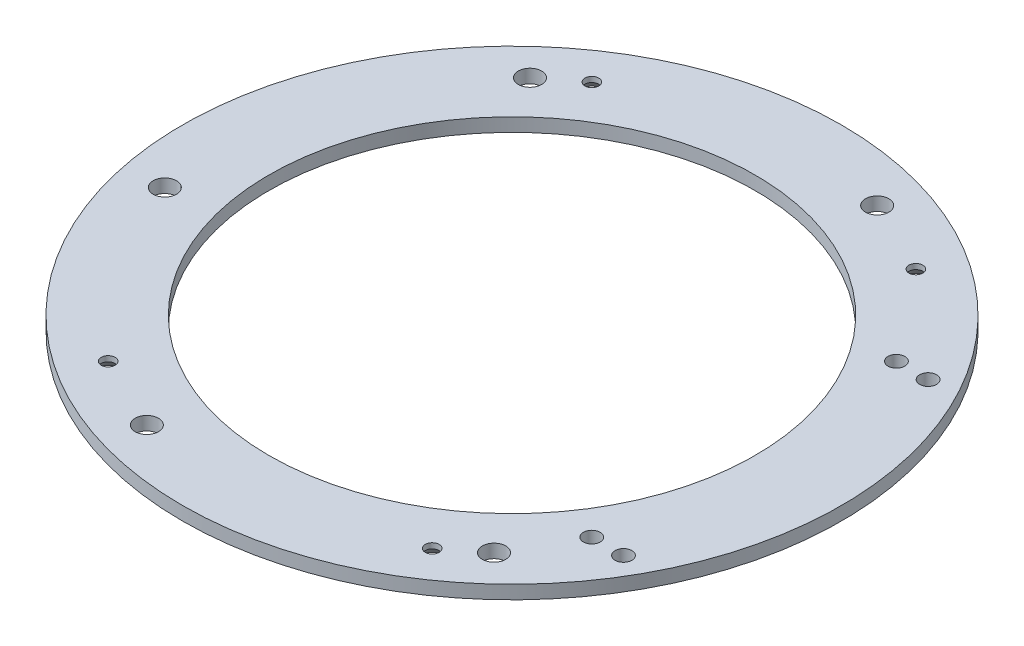
ISO-10303-21;
HEADER;
FILE_DESCRIPTION(('STEP AP214'),'2;1');
FILE_NAME('part.step','',(''),(''),'','','');
FILE_SCHEMA(('AUTOMOTIVE_DESIGN { 1 0 10303 214 1 1 1 1 }'));
ENDSEC;
DATA;
#1=APPLICATION_CONTEXT('core data for automotive mechanical design processes');
#2=APPLICATION_PROTOCOL_DEFINITION('international standard','automotive_design',2000,#1);
#3=PRODUCT_CONTEXT('',#1,'mechanical');
#4=PRODUCT('Part','Part','',(#3));
#5=PRODUCT_RELATED_PRODUCT_CATEGORY('part','',(#4));
#6=PRODUCT_DEFINITION_FORMATION('','',#4);
#7=PRODUCT_DEFINITION_CONTEXT('part definition',#1,'design');
#8=PRODUCT_DEFINITION('design','',#6,#7);
#9=PRODUCT_DEFINITION_SHAPE('','',#8);
#10=(LENGTH_UNIT() NAMED_UNIT(*) SI_UNIT(.MILLI.,.METRE.));
#11=(NAMED_UNIT(*) PLANE_ANGLE_UNIT() SI_UNIT($,.RADIAN.));
#12=(NAMED_UNIT(*) SI_UNIT($,.STERADIAN.) SOLID_ANGLE_UNIT());
#13=UNCERTAINTY_MEASURE_WITH_UNIT(LENGTH_MEASURE(1.E-05),#10,'distance_accuracy_value','');
#14=(GEOMETRIC_REPRESENTATION_CONTEXT(3) GLOBAL_UNCERTAINTY_ASSIGNED_CONTEXT((#13)) GLOBAL_UNIT_ASSIGNED_CONTEXT((#10,
#11,#12)) REPRESENTATION_CONTEXT('',''));
#15=CARTESIAN_POINT('',(0.,0.,0.));
#16=DIRECTION('',(0.,0.,1.));
#17=DIRECTION('',(1.,0.,0.));
#18=AXIS2_PLACEMENT_3D('',#15,#16,#17);
#19=CARTESIAN_POINT('',(0.,-43.50766,0.));
#20=DIRECTION('',(0.,1.,0.));
#21=DIRECTION('',(0.,0.,1.));
#22=AXIS2_PLACEMENT_3D('',#19,#20,#21);
#23=PLANE('',#22);
#24=CARTESIAN_POINT('',(62.0316676222717,-43.50766,35.8140000000001));
#25=DIRECTION('',(0.,1.,0.));
#26=DIRECTION('',(0.,0.,1.));
#27=AXIS2_PLACEMENT_3D('',#24,#25,#26);
#28=CIRCLE('',#27,1.984375);
#29=CARTESIAN_POINT('',(62.0316676222717,-43.50766,37.7983750000001));
#30=VERTEX_POINT('',#29);
#31=EDGE_CURVE('E154',#30,#30,#28,.T.);
#32=ORIENTED_EDGE('',*,*,#31,.T.);
#33=EDGE_LOOP('',(#32));
#34=FACE_BOUND('',#33,.T.);
#35=CARTESIAN_POINT('',(54.5763198466148,-43.50766,35.8140000000001));
#36=DIRECTION('',(0.,1.,0.));
#37=DIRECTION('',(0.,0.,1.));
#38=AXIS2_PLACEMENT_3D('',#35,#36,#37);
#39=CIRCLE('',#38,1.984375);
#40=CARTESIAN_POINT('',(54.5763198466148,-43.50766,37.7983750000001));
#41=VERTEX_POINT('',#40);
#42=EDGE_CURVE('E148',#41,#41,#39,.T.);
#43=ORIENTED_EDGE('',*,*,#42,.T.);
#44=EDGE_LOOP('',(#43));
#45=FACE_BOUND('',#44,.T.);
#46=CARTESIAN_POINT('',(54.5763198466148,-43.50766,-35.8140000000001));
#47=DIRECTION('',(0.,1.,0.));
#48=DIRECTION('',(0.,0.,1.));
#49=AXIS2_PLACEMENT_3D('',#46,#47,#48);
#50=CIRCLE('',#49,1.984375);
#51=CARTESIAN_POINT('',(54.5763198466148,-43.50766,-33.8296250000001));
#52=VERTEX_POINT('',#51);
#53=EDGE_CURVE('E142',#52,#52,#50,.T.);
#54=ORIENTED_EDGE('',*,*,#53,.T.);
#55=EDGE_LOOP('',(#54));
#56=FACE_BOUND('',#55,.T.);
#57=CARTESIAN_POINT('',(62.0316676222717,-43.50766,-35.8140000000001));
#58=DIRECTION('',(0.,1.,0.));
#59=DIRECTION('',(0.,0.,1.));
#60=AXIS2_PLACEMENT_3D('',#57,#58,#59);
#61=CIRCLE('',#60,1.984375);
#62=CARTESIAN_POINT('',(62.0316676222717,-43.50766,-33.8296250000001));
#63=VERTEX_POINT('',#62);
#64=EDGE_CURVE('E136',#63,#63,#61,.T.);
#65=ORIENTED_EDGE('',*,*,#64,.T.);
#66=EDGE_LOOP('',(#65));
#67=FACE_BOUND('',#66,.T.);
#68=CARTESIAN_POINT('',(38.1,-43.50766,56.8700554685856));
#69=DIRECTION('',(0.,-1.,0.));
#70=DIRECTION('',(0.,0.,-1.));
#71=AXIS2_PLACEMENT_3D('',#68,#69,#70);
#72=CIRCLE('',#71,3.302);
#73=CARTESIAN_POINT('',(38.1,-43.50766,53.5680554685856));
#74=VERTEX_POINT('',#73);
#75=EDGE_CURVE('E115',#74,#74,#72,.T.);
#76=ORIENTED_EDGE('',*,*,#75,.F.);
#77=EDGE_LOOP('',(#76));
#78=FACE_BOUND('',#77,.T.);
#79=CARTESIAN_POINT('',(20.5842140934656,-43.50766,-65.2847864295685));
#80=DIRECTION('',(0.,1.,0.));
#81=DIRECTION('',(0.,0.,1.));
#82=AXIS2_PLACEMENT_3D('',#79,#80,#81);
#83=CIRCLE('',#82,2.75);
#84=CARTESIAN_POINT('',(20.5842140934656,-43.50766,-62.5347864295685));
#85=VERTEX_POINT('',#84);
#86=EDGE_CURVE('E94',#85,#85,#83,.T.);
#87=ORIENTED_EDGE('',*,*,#86,.T.);
#88=EDGE_LOOP('',(#87));
#89=FACE_BOUND('',#88,.T.);
#90=CARTESIAN_POINT('',(46.2461764819152,-43.50766,50.4688455366631));
#91=DIRECTION('',(0.,1.,0.));
#92=DIRECTION('',(0.,0.,1.));
#93=AXIS2_PLACEMENT_3D('',#90,#91,#92);
#94=CIRCLE('',#93,2.75);
#95=CARTESIAN_POINT('',(46.2461764819152,-43.50766,53.2188455366631));
#96=VERTEX_POINT('',#95);
#97=EDGE_CURVE('E88',#96,#96,#94,.T.);
#98=ORIENTED_EDGE('',*,*,#97,.T.);
#99=EDGE_LOOP('',(#98));
#100=FACE_BOUND('',#99,.T.);
#101=CARTESIAN_POINT('',(-20.5842140934656,-43.50766,65.2847864295685));
#102=DIRECTION('',(0.,1.,0.));
#103=DIRECTION('',(0.,0.,1.));
#104=AXIS2_PLACEMENT_3D('',#101,#102,#103);
#105=CIRCLE('',#104,2.75);
#106=CARTESIAN_POINT('',(-20.5842140934656,-43.50766,68.0347864295685));
#107=VERTEX_POINT('',#106);
#108=EDGE_CURVE('E82',#107,#107,#105,.T.);
#109=ORIENTED_EDGE('',*,*,#108,.T.);
#110=EDGE_LOOP('',(#109));
#111=FACE_BOUND('',#110,.T.);
#112=CARTESIAN_POINT('',(-46.2461764819152,-43.50766,-50.4688455366631));
#113=DIRECTION('',(0.,1.,0.));
#114=DIRECTION('',(0.,0.,1.));
#115=AXIS2_PLACEMENT_3D('',#112,#113,#114);
#116=CIRCLE('',#115,2.75);
#117=CARTESIAN_POINT('',(-46.2461764819152,-43.50766,-47.7188455366631));
#118=VERTEX_POINT('',#117);
#119=EDGE_CURVE('E73',#118,#118,#116,.T.);
#120=ORIENTED_EDGE('',*,*,#119,.T.);
#121=EDGE_LOOP('',(#120));
#122=FACE_BOUND('',#121,.T.);
#123=CARTESIAN_POINT('',(-66.8303905753807,-43.50766,14.8159408929054));
#124=DIRECTION('',(0.,1.,0.));
#125=DIRECTION('',(0.,0.,1.));
#126=AXIS2_PLACEMENT_3D('',#123,#124,#125);
#127=CIRCLE('',#126,2.75);
#128=CARTESIAN_POINT('',(-66.8303905753807,-43.50766,17.5659408929054));
#129=VERTEX_POINT('',#128);
#130=EDGE_CURVE('E63',#129,#129,#127,.T.);
#131=ORIENTED_EDGE('',*,*,#130,.T.);
#132=EDGE_LOOP('',(#131));
#133=FACE_BOUND('',#132,.T.);
#134=CARTESIAN_POINT('',(0.,-43.50766,0.));
#135=DIRECTION('',(0.,1.,0.));
#136=DIRECTION('',(0.,0.,1.));
#137=AXIS2_PLACEMENT_3D('',#134,#135,#136);
#138=CIRCLE('',#137,77.4954);
#139=CARTESIAN_POINT('',(0.,-43.50766,77.4954));
#140=VERTEX_POINT('',#139);
#141=EDGE_CURVE('E10',#140,#140,#138,.F.);
#142=ORIENTED_EDGE('',*,*,#141,.T.);
#143=EDGE_LOOP('',(#142));
#144=FACE_BOUND('',#143,.T.);
#145=CARTESIAN_POINT('',(0.,-43.50766,0.));
#146=DIRECTION('',(0.,1.,0.));
#147=DIRECTION('',(0.,0.,1.));
#148=AXIS2_PLACEMENT_3D('',#145,#146,#147);
#149=CIRCLE('',#148,57.15);
#150=CARTESIAN_POINT('',(0.,-43.50766,57.15));
#151=VERTEX_POINT('',#150);
#152=EDGE_CURVE('E60',#151,#151,#149,.F.);
#153=ORIENTED_EDGE('',*,*,#152,.F.);
#154=EDGE_LOOP('',(#153));
#155=FACE_BOUND('',#154,.T.);
#156=CARTESIAN_POINT('',(-38.1,-43.50766,56.8700554685856));
#157=DIRECTION('',(0.,-1.,0.));
#158=DIRECTION('',(0.,0.,-1.));
#159=AXIS2_PLACEMENT_3D('',#156,#157,#158);
#160=CIRCLE('',#159,3.302);
#161=CARTESIAN_POINT('',(-38.1,-43.50766,53.5680554685856));
#162=VERTEX_POINT('',#161);
#163=EDGE_CURVE('E106',#162,#162,#160,.T.);
#164=ORIENTED_EDGE('',*,*,#163,.F.);
#165=EDGE_LOOP('',(#164));
#166=FACE_BOUND('',#165,.T.);
#167=CARTESIAN_POINT('',(-38.1,-43.50766,-56.8700554685856));
#168=DIRECTION('',(0.,-1.,0.));
#169=DIRECTION('',(0.,0.,-1.));
#170=AXIS2_PLACEMENT_3D('',#167,#168,#169);
#171=CIRCLE('',#170,3.302);
#172=CARTESIAN_POINT('',(-38.1,-43.50766,-60.1720554685856));
#173=VERTEX_POINT('',#172);
#174=EDGE_CURVE('E124',#173,#173,#171,.T.);
#175=ORIENTED_EDGE('',*,*,#174,.F.);
#176=EDGE_LOOP('',(#175));
#177=FACE_BOUND('',#176,.T.);
#178=CARTESIAN_POINT('',(38.1,-43.50766,-56.8700554685856));
#179=DIRECTION('',(0.,-1.,0.));
#180=DIRECTION('',(0.,0.,-1.));
#181=AXIS2_PLACEMENT_3D('',#178,#179,#180);
#182=CIRCLE('',#181,3.302);
#183=CARTESIAN_POINT('',(38.1,-43.50766,-60.1720554685856));
#184=VERTEX_POINT('',#183);
#185=EDGE_CURVE('E133',#184,#184,#182,.T.);
#186=ORIENTED_EDGE('',*,*,#185,.F.);
#187=EDGE_LOOP('',(#186));
#188=FACE_BOUND('',#187,.T.);
#189=ADVANCED_FACE('F45',(#34,#45,#56,#67,#78,#89,#100,#111,#122,#133,#144,#155,#166,#177,#188),
#23,.F.);
#190=CARTESIAN_POINT('',(0.,-262.697751403056,0.));
#191=DIRECTION('',(0.,1.,0.));
#192=DIRECTION('',(0.,0.,1.));
#193=AXIS2_PLACEMENT_3D('',#190,#191,#192);
#194=CYLINDRICAL_SURFACE('',#193,57.15);
#195=ORIENTED_EDGE('',*,*,#152,.T.);
#196=EDGE_LOOP('',(#195));
#197=FACE_BOUND('',#196,.T.);
#198=CARTESIAN_POINT('',(0.,-40.33266,0.));
#199=DIRECTION('',(0.,1.,0.));
#200=DIRECTION('',(0.,0.,1.));
#201=AXIS2_PLACEMENT_3D('',#198,#199,#200);
#202=CIRCLE('',#201,57.15);
#203=CARTESIAN_POINT('',(0.,-40.33266,57.15));
#204=VERTEX_POINT('',#203);
#205=EDGE_CURVE('E55',#204,#204,#202,.T.);
#206=ORIENTED_EDGE('',*,*,#205,.T.);
#207=EDGE_LOOP('',(#206));
#208=FACE_BOUND('',#207,.T.);
#209=ADVANCED_FACE('F194',(#197,#208),#194,.F.);
#210=CARTESIAN_POINT('',(0.,-262.697751403056,0.));
#211=DIRECTION('',(0.,1.,0.));
#212=DIRECTION('',(0.,0.,1.));
#213=AXIS2_PLACEMENT_3D('',#210,#211,#212);
#214=CYLINDRICAL_SURFACE('',#213,77.4954);
#215=ORIENTED_EDGE('',*,*,#141,.F.);
#216=EDGE_LOOP('',(#215));
#217=FACE_BOUND('',#216,.T.);
#218=CARTESIAN_POINT('',(0.,-40.33266,0.));
#219=DIRECTION('',(0.,1.,0.));
#220=DIRECTION('',(0.,0.,1.));
#221=AXIS2_PLACEMENT_3D('',#218,#219,#220);
#222=CIRCLE('',#221,77.4954);
#223=CARTESIAN_POINT('',(0.,-40.33266,77.4954));
#224=VERTEX_POINT('',#223);
#225=EDGE_CURVE('E51',#224,#224,#222,.T.);
#226=ORIENTED_EDGE('',*,*,#225,.F.);
#227=EDGE_LOOP('',(#226));
#228=FACE_BOUND('',#227,.T.);
#229=ADVANCED_FACE('F167',(#217,#228),#214,.T.);
#230=CARTESIAN_POINT('',(0.,-40.33266,0.));
#231=DIRECTION('',(0.,1.,0.));
#232=DIRECTION('',(0.,0.,1.));
#233=AXIS2_PLACEMENT_3D('',#230,#231,#232);
#234=PLANE('',#233);
#235=CARTESIAN_POINT('',(62.0316676222717,-40.33266,35.8140000000001));
#236=DIRECTION('',(0.,1.,0.));
#237=DIRECTION('',(0.,0.,1.));
#238=AXIS2_PLACEMENT_3D('',#235,#236,#237);
#239=CIRCLE('',#238,1.984375);
#240=CARTESIAN_POINT('',(62.0316676222717,-40.33266,37.7983750000001));
#241=VERTEX_POINT('',#240);
#242=EDGE_CURVE('E157',#241,#241,#239,.T.);
#243=ORIENTED_EDGE('',*,*,#242,.F.);
#244=EDGE_LOOP('',(#243));
#245=FACE_BOUND('',#244,.T.);
#246=CARTESIAN_POINT('',(54.5763198466148,-40.33266,35.8140000000001));
#247=DIRECTION('',(0.,1.,0.));
#248=DIRECTION('',(0.,0.,1.));
#249=AXIS2_PLACEMENT_3D('',#246,#247,#248);
#250=CIRCLE('',#249,1.984375);
#251=CARTESIAN_POINT('',(54.5763198466148,-40.33266,37.7983750000001));
#252=VERTEX_POINT('',#251);
#253=EDGE_CURVE('E151',#252,#252,#250,.T.);
#254=ORIENTED_EDGE('',*,*,#253,.F.);
#255=EDGE_LOOP('',(#254));
#256=FACE_BOUND('',#255,.T.);
#257=CARTESIAN_POINT('',(54.5763198466148,-40.33266,-35.8140000000001));
#258=DIRECTION('',(0.,1.,0.));
#259=DIRECTION('',(0.,0.,1.));
#260=AXIS2_PLACEMENT_3D('',#257,#258,#259);
#261=CIRCLE('',#260,1.984375);
#262=CARTESIAN_POINT('',(54.5763198466148,-40.33266,-33.8296250000001));
#263=VERTEX_POINT('',#262);
#264=EDGE_CURVE('E145',#263,#263,#261,.T.);
#265=ORIENTED_EDGE('',*,*,#264,.F.);
#266=EDGE_LOOP('',(#265));
#267=FACE_BOUND('',#266,.T.);
#268=CARTESIAN_POINT('',(62.0316676222717,-40.33266,-35.8140000000001));
#269=DIRECTION('',(0.,1.,0.));
#270=DIRECTION('',(0.,0.,1.));
#271=AXIS2_PLACEMENT_3D('',#268,#269,#270);
#272=CIRCLE('',#271,1.984375);
#273=CARTESIAN_POINT('',(62.0316676222717,-40.33266,-33.8296250000001));
#274=VERTEX_POINT('',#273);
#275=EDGE_CURVE('E139',#274,#274,#272,.T.);
#276=ORIENTED_EDGE('',*,*,#275,.F.);
#277=EDGE_LOOP('',(#276));
#278=FACE_BOUND('',#277,.T.);
#279=CARTESIAN_POINT('',(38.1,-40.33266,-56.8700554685856));
#280=DIRECTION('',(0.,1.,0.));
#281=DIRECTION('',(0.,0.,1.));
#282=AXIS2_PLACEMENT_3D('',#279,#280,#281);
#283=CIRCLE('',#282,1.63195);
#284=CARTESIAN_POINT('',(38.1,-40.33266,-55.2381054685856));
#285=VERTEX_POINT('',#284);
#286=EDGE_CURVE('E127',#285,#285,#283,.T.);
#287=ORIENTED_EDGE('',*,*,#286,.F.);
#288=EDGE_LOOP('',(#287));
#289=FACE_BOUND('',#288,.T.);
#290=CARTESIAN_POINT('',(-38.1,-40.33266,-56.8700554685856));
#291=DIRECTION('',(0.,1.,0.));
#292=DIRECTION('',(0.,0.,1.));
#293=AXIS2_PLACEMENT_3D('',#290,#291,#292);
#294=CIRCLE('',#293,1.63195);
#295=CARTESIAN_POINT('',(-38.1,-40.33266,-55.2381054685856));
#296=VERTEX_POINT('',#295);
#297=EDGE_CURVE('E118',#296,#296,#294,.T.);
#298=ORIENTED_EDGE('',*,*,#297,.F.);
#299=EDGE_LOOP('',(#298));
#300=FACE_BOUND('',#299,.T.);
#301=CARTESIAN_POINT('',(38.1,-40.33266,56.8700554685856));
#302=DIRECTION('',(0.,1.,0.));
#303=DIRECTION('',(0.,0.,1.));
#304=AXIS2_PLACEMENT_3D('',#301,#302,#303);
#305=CIRCLE('',#304,1.63195);
#306=CARTESIAN_POINT('',(38.1,-40.33266,58.5020054685856));
#307=VERTEX_POINT('',#306);
#308=EDGE_CURVE('E109',#307,#307,#305,.T.);
#309=ORIENTED_EDGE('',*,*,#308,.F.);
#310=EDGE_LOOP('',(#309));
#311=FACE_BOUND('',#310,.T.);
#312=CARTESIAN_POINT('',(-38.1,-40.33266,56.8700554685856));
#313=DIRECTION('',(0.,1.,0.));
#314=DIRECTION('',(0.,0.,1.));
#315=AXIS2_PLACEMENT_3D('',#312,#313,#314);
#316=CIRCLE('',#315,1.63195);
#317=CARTESIAN_POINT('',(-38.1,-40.33266,58.5020054685856));
#318=VERTEX_POINT('',#317);
#319=EDGE_CURVE('E100',#318,#318,#316,.T.);
#320=ORIENTED_EDGE('',*,*,#319,.F.);
#321=EDGE_LOOP('',(#320));
#322=FACE_BOUND('',#321,.T.);
#323=CARTESIAN_POINT('',(20.5842140934656,-40.33266,-65.2847864295685));
#324=DIRECTION('',(0.,1.,0.));
#325=DIRECTION('',(0.,0.,1.));
#326=AXIS2_PLACEMENT_3D('',#323,#324,#325);
#327=CIRCLE('',#326,2.75);
#328=CARTESIAN_POINT('',(20.5842140934656,-40.33266,-62.5347864295685));
#329=VERTEX_POINT('',#328);
#330=EDGE_CURVE('E97',#329,#329,#327,.T.);
#331=ORIENTED_EDGE('',*,*,#330,.F.);
#332=EDGE_LOOP('',(#331));
#333=FACE_BOUND('',#332,.T.);
#334=CARTESIAN_POINT('',(46.2461764819152,-40.33266,50.4688455366631));
#335=DIRECTION('',(0.,1.,0.));
#336=DIRECTION('',(0.,0.,1.));
#337=AXIS2_PLACEMENT_3D('',#334,#335,#336);
#338=CIRCLE('',#337,2.75);
#339=CARTESIAN_POINT('',(46.2461764819152,-40.33266,53.2188455366631));
#340=VERTEX_POINT('',#339);
#341=EDGE_CURVE('E91',#340,#340,#338,.T.);
#342=ORIENTED_EDGE('',*,*,#341,.F.);
#343=EDGE_LOOP('',(#342));
#344=FACE_BOUND('',#343,.T.);
#345=CARTESIAN_POINT('',(-20.5842140934656,-40.33266,65.2847864295685));
#346=DIRECTION('',(0.,1.,0.));
#347=DIRECTION('',(0.,0.,1.));
#348=AXIS2_PLACEMENT_3D('',#345,#346,#347);
#349=CIRCLE('',#348,2.75);
#350=CARTESIAN_POINT('',(-20.5842140934656,-40.33266,68.0347864295685));
#351=VERTEX_POINT('',#350);
#352=EDGE_CURVE('E85',#351,#351,#349,.T.);
#353=ORIENTED_EDGE('',*,*,#352,.F.);
#354=EDGE_LOOP('',(#353));
#355=FACE_BOUND('',#354,.T.);
#356=CARTESIAN_POINT('',(-46.2461764819152,-40.33266,-50.4688455366631));
#357=DIRECTION('',(0.,1.,0.));
#358=DIRECTION('',(0.,0.,1.));
#359=AXIS2_PLACEMENT_3D('',#356,#357,#358);
#360=CIRCLE('',#359,2.75);
#361=CARTESIAN_POINT('',(-46.2461764819152,-40.33266,-47.7188455366631));
#362=VERTEX_POINT('',#361);
#363=EDGE_CURVE('E77',#362,#362,#360,.T.);
#364=ORIENTED_EDGE('',*,*,#363,.F.);
#365=EDGE_LOOP('',(#364));
#366=FACE_BOUND('',#365,.T.);
#367=CARTESIAN_POINT('',(-66.8303905753807,-40.33266,14.8159408929054));
#368=DIRECTION('',(0.,1.,0.));
#369=DIRECTION('',(0.,0.,1.));
#370=AXIS2_PLACEMENT_3D('',#367,#368,#369);
#371=CIRCLE('',#370,2.75);
#372=CARTESIAN_POINT('',(-66.8303905753807,-40.33266,17.5659408929054));
#373=VERTEX_POINT('',#372);
#374=EDGE_CURVE('E69',#373,#373,#371,.T.);
#375=ORIENTED_EDGE('',*,*,#374,.F.);
#376=EDGE_LOOP('',(#375));
#377=FACE_BOUND('',#376,.T.);
#378=ORIENTED_EDGE('',*,*,#205,.F.);
#379=EDGE_LOOP('',(#378));
#380=FACE_BOUND('',#379,.T.);
#381=ORIENTED_EDGE('',*,*,#225,.T.);
#382=EDGE_LOOP('',(#381));
#383=FACE_BOUND('',#382,.T.);
#384=ADVANCED_FACE('F163',(#245,#256,#267,#278,#289,#300,#311,#322,#333,#344,#355,#366,#377,
#380,#383),#234,.T.);
#385=CARTESIAN_POINT('',(-66.8303905753807,-40.33266,14.8159408929054));
#386=DIRECTION('',(0.,1.,0.));
#387=DIRECTION('',(0.,0.,1.));
#388=AXIS2_PLACEMENT_3D('',#385,#386,#387);
#389=CYLINDRICAL_SURFACE('',#388,2.75);
#390=ORIENTED_EDGE('',*,*,#130,.F.);
#391=EDGE_LOOP('',(#390));
#392=FACE_BOUND('',#391,.T.);
#393=ORIENTED_EDGE('',*,*,#374,.T.);
#394=EDGE_LOOP('',(#393));
#395=FACE_BOUND('',#394,.T.);
#396=ADVANCED_FACE('F166',(#392,#395),#389,.F.);
#397=CARTESIAN_POINT('',(-46.2461764819152,-40.33266,-50.4688455366631));
#398=DIRECTION('',(0.,1.,0.));
#399=DIRECTION('',(0.,0.,1.));
#400=AXIS2_PLACEMENT_3D('',#397,#398,#399);
#401=CYLINDRICAL_SURFACE('',#400,2.75);
#402=ORIENTED_EDGE('',*,*,#119,.F.);
#403=EDGE_LOOP('',(#402));
#404=FACE_BOUND('',#403,.T.);
#405=ORIENTED_EDGE('',*,*,#363,.T.);
#406=EDGE_LOOP('',(#405));
#407=FACE_BOUND('',#406,.T.);
#408=ADVANCED_FACE('F206',(#404,#407),#401,.F.);
#409=CARTESIAN_POINT('',(-20.5842140934656,-40.33266,65.2847864295685));
#410=DIRECTION('',(0.,1.,0.));
#411=DIRECTION('',(0.,0.,1.));
#412=AXIS2_PLACEMENT_3D('',#409,#410,#411);
#413=CYLINDRICAL_SURFACE('',#412,2.75);
#414=ORIENTED_EDGE('',*,*,#108,.F.);
#415=EDGE_LOOP('',(#414));
#416=FACE_BOUND('',#415,.T.);
#417=ORIENTED_EDGE('',*,*,#352,.T.);
#418=EDGE_LOOP('',(#417));
#419=FACE_BOUND('',#418,.T.);
#420=ADVANCED_FACE('F210',(#416,#419),#413,.F.);
#421=CARTESIAN_POINT('',(46.2461764819152,-40.33266,50.4688455366631));
#422=DIRECTION('',(0.,1.,0.));
#423=DIRECTION('',(0.,0.,1.));
#424=AXIS2_PLACEMENT_3D('',#421,#422,#423);
#425=CYLINDRICAL_SURFACE('',#424,2.75);
#426=ORIENTED_EDGE('',*,*,#97,.F.);
#427=EDGE_LOOP('',(#426));
#428=FACE_BOUND('',#427,.T.);
#429=ORIENTED_EDGE('',*,*,#341,.T.);
#430=EDGE_LOOP('',(#429));
#431=FACE_BOUND('',#430,.T.);
#432=ADVANCED_FACE('F214',(#428,#431),#425,.F.);
#433=CARTESIAN_POINT('',(20.5842140934656,-40.33266,-65.2847864295685));
#434=DIRECTION('',(0.,1.,0.));
#435=DIRECTION('',(0.,0.,1.));
#436=AXIS2_PLACEMENT_3D('',#433,#434,#435);
#437=CYLINDRICAL_SURFACE('',#436,2.75);
#438=ORIENTED_EDGE('',*,*,#86,.F.);
#439=EDGE_LOOP('',(#438));
#440=FACE_BOUND('',#439,.T.);
#441=ORIENTED_EDGE('',*,*,#330,.T.);
#442=EDGE_LOOP('',(#441));
#443=FACE_BOUND('',#442,.T.);
#444=ADVANCED_FACE('F218',(#440,#443),#437,.F.);
#445=CARTESIAN_POINT('',(-38.1,-43.50766,56.8700554685856));
#446=DIRECTION('',(0.,-1.,0.));
#447=DIRECTION('',(0.,0.,-1.));
#448=AXIS2_PLACEMENT_3D('',#445,#446,#447);
#449=CYLINDRICAL_SURFACE('',#448,1.63195);
#450=CARTESIAN_POINT('',(-38.1,-41.5864872415205,56.8700554685856));
#451=DIRECTION('',(0.,-1.,0.));
#452=DIRECTION('',(0.,0.,-1.));
#453=AXIS2_PLACEMENT_3D('',#450,#451,#452);
#454=CIRCLE('',#453,1.63195);
#455=CARTESIAN_POINT('',(-38.1,-41.5864872415205,55.2381054685856));
#456=VERTEX_POINT('',#455);
#457=EDGE_CURVE('E103',#456,#456,#454,.T.);
#458=ORIENTED_EDGE('',*,*,#457,.T.);
#459=EDGE_LOOP('',(#458));
#460=FACE_BOUND('',#459,.T.);
#461=ORIENTED_EDGE('',*,*,#319,.T.);
#462=EDGE_LOOP('',(#461));
#463=FACE_BOUND('',#462,.T.);
#464=ADVANCED_FACE('F222',(#460,#463),#449,.F.);
#465=CARTESIAN_POINT('',(-38.1,-43.50766,56.8700554685856));
#466=DIRECTION('',(0.,-1.,0.));
#467=DIRECTION('',(0.,0.,-1.));
#468=AXIS2_PLACEMENT_3D('',#465,#466,#467);
#469=CONICAL_SURFACE('',#468,3.302,0.715584993317674);
#470=ORIENTED_EDGE('',*,*,#457,.F.);
#471=EDGE_LOOP('',(#470));
#472=FACE_BOUND('',#471,.T.);
#473=ORIENTED_EDGE('',*,*,#163,.T.);
#474=EDGE_LOOP('',(#473));
#475=FACE_BOUND('',#474,.T.);
#476=ADVANCED_FACE('F226',(#472,#475),#469,.F.);
#477=CARTESIAN_POINT('',(38.1,-43.50766,56.8700554685856));
#478=DIRECTION('',(0.,-1.,0.));
#479=DIRECTION('',(0.,0.,-1.));
#480=AXIS2_PLACEMENT_3D('',#477,#478,#479);
#481=CYLINDRICAL_SURFACE('',#480,1.63195);
#482=CARTESIAN_POINT('',(38.1,-41.5864872415205,56.8700554685856));
#483=DIRECTION('',(0.,-1.,0.));
#484=DIRECTION('',(0.,0.,-1.));
#485=AXIS2_PLACEMENT_3D('',#482,#483,#484);
#486=CIRCLE('',#485,1.63195);
#487=CARTESIAN_POINT('',(38.1,-41.5864872415205,55.2381054685856));
#488=VERTEX_POINT('',#487);
#489=EDGE_CURVE('E112',#488,#488,#486,.T.);
#490=ORIENTED_EDGE('',*,*,#489,.T.);
#491=EDGE_LOOP('',(#490));
#492=FACE_BOUND('',#491,.T.);
#493=ORIENTED_EDGE('',*,*,#308,.T.);
#494=EDGE_LOOP('',(#493));
#495=FACE_BOUND('',#494,.T.);
#496=ADVANCED_FACE('F230',(#492,#495),#481,.F.);
#497=CARTESIAN_POINT('',(38.1,-43.50766,56.8700554685856));
#498=DIRECTION('',(0.,-1.,0.));
#499=DIRECTION('',(0.,0.,-1.));
#500=AXIS2_PLACEMENT_3D('',#497,#498,#499);
#501=CONICAL_SURFACE('',#500,3.302,0.715584993317674);
#502=ORIENTED_EDGE('',*,*,#489,.F.);
#503=EDGE_LOOP('',(#502));
#504=FACE_BOUND('',#503,.T.);
#505=ORIENTED_EDGE('',*,*,#75,.T.);
#506=EDGE_LOOP('',(#505));
#507=FACE_BOUND('',#506,.T.);
#508=ADVANCED_FACE('F234',(#504,#507),#501,.F.);
#509=CARTESIAN_POINT('',(-38.1,-43.50766,-56.8700554685856));
#510=DIRECTION('',(0.,-1.,0.));
#511=DIRECTION('',(0.,0.,-1.));
#512=AXIS2_PLACEMENT_3D('',#509,#510,#511);
#513=CYLINDRICAL_SURFACE('',#512,1.63195);
#514=CARTESIAN_POINT('',(-38.1,-41.5864872415205,-56.8700554685856));
#515=DIRECTION('',(0.,-1.,0.));
#516=DIRECTION('',(0.,0.,-1.));
#517=AXIS2_PLACEMENT_3D('',#514,#515,#516);
#518=CIRCLE('',#517,1.63195);
#519=CARTESIAN_POINT('',(-38.1,-41.5864872415205,-58.5020054685856));
#520=VERTEX_POINT('',#519);
#521=EDGE_CURVE('E121',#520,#520,#518,.T.);
#522=ORIENTED_EDGE('',*,*,#521,.T.);
#523=EDGE_LOOP('',(#522));
#524=FACE_BOUND('',#523,.T.);
#525=ORIENTED_EDGE('',*,*,#297,.T.);
#526=EDGE_LOOP('',(#525));
#527=FACE_BOUND('',#526,.T.);
#528=ADVANCED_FACE('F238',(#524,#527),#513,.F.);
#529=CARTESIAN_POINT('',(-38.1,-43.50766,-56.8700554685856));
#530=DIRECTION('',(0.,-1.,0.));
#531=DIRECTION('',(0.,0.,-1.));
#532=AXIS2_PLACEMENT_3D('',#529,#530,#531);
#533=CONICAL_SURFACE('',#532,3.302,0.715584993317674);
#534=ORIENTED_EDGE('',*,*,#521,.F.);
#535=EDGE_LOOP('',(#534));
#536=FACE_BOUND('',#535,.T.);
#537=ORIENTED_EDGE('',*,*,#174,.T.);
#538=EDGE_LOOP('',(#537));
#539=FACE_BOUND('',#538,.T.);
#540=ADVANCED_FACE('F242',(#536,#539),#533,.F.);
#541=CARTESIAN_POINT('',(38.1,-43.50766,-56.8700554685856));
#542=DIRECTION('',(0.,-1.,0.));
#543=DIRECTION('',(0.,0.,-1.));
#544=AXIS2_PLACEMENT_3D('',#541,#542,#543);
#545=CYLINDRICAL_SURFACE('',#544,1.63195);
#546=CARTESIAN_POINT('',(38.1,-41.5864872415205,-56.8700554685856));
#547=DIRECTION('',(0.,-1.,0.));
#548=DIRECTION('',(0.,0.,-1.));
#549=AXIS2_PLACEMENT_3D('',#546,#547,#548);
#550=CIRCLE('',#549,1.63195);
#551=CARTESIAN_POINT('',(38.1,-41.5864872415205,-58.5020054685856));
#552=VERTEX_POINT('',#551);
#553=EDGE_CURVE('E130',#552,#552,#550,.T.);
#554=ORIENTED_EDGE('',*,*,#553,.T.);
#555=EDGE_LOOP('',(#554));
#556=FACE_BOUND('',#555,.T.);
#557=ORIENTED_EDGE('',*,*,#286,.T.);
#558=EDGE_LOOP('',(#557));
#559=FACE_BOUND('',#558,.T.);
#560=ADVANCED_FACE('F246',(#556,#559),#545,.F.);
#561=CARTESIAN_POINT('',(38.1,-43.50766,-56.8700554685856));
#562=DIRECTION('',(0.,-1.,0.));
#563=DIRECTION('',(0.,0.,-1.));
#564=AXIS2_PLACEMENT_3D('',#561,#562,#563);
#565=CONICAL_SURFACE('',#564,3.302,0.715584993317674);
#566=ORIENTED_EDGE('',*,*,#553,.F.);
#567=EDGE_LOOP('',(#566));
#568=FACE_BOUND('',#567,.T.);
#569=ORIENTED_EDGE('',*,*,#185,.T.);
#570=EDGE_LOOP('',(#569));
#571=FACE_BOUND('',#570,.T.);
#572=ADVANCED_FACE('F250',(#568,#571),#565,.F.);
#573=CARTESIAN_POINT('',(62.0316676222717,-40.33266,-35.8140000000001));
#574=DIRECTION('',(0.,1.,0.));
#575=DIRECTION('',(0.,0.,1.));
#576=AXIS2_PLACEMENT_3D('',#573,#574,#575);
#577=CYLINDRICAL_SURFACE('',#576,1.984375);
#578=ORIENTED_EDGE('',*,*,#64,.F.);
#579=EDGE_LOOP('',(#578));
#580=FACE_BOUND('',#579,.T.);
#581=ORIENTED_EDGE('',*,*,#275,.T.);
#582=EDGE_LOOP('',(#581));
#583=FACE_BOUND('',#582,.T.);
#584=ADVANCED_FACE('F254',(#580,#583),#577,.F.);
#585=CARTESIAN_POINT('',(54.5763198466148,-40.33266,-35.8140000000001));
#586=DIRECTION('',(0.,1.,0.));
#587=DIRECTION('',(0.,0.,1.));
#588=AXIS2_PLACEMENT_3D('',#585,#586,#587);
#589=CYLINDRICAL_SURFACE('',#588,1.984375);
#590=ORIENTED_EDGE('',*,*,#53,.F.);
#591=EDGE_LOOP('',(#590));
#592=FACE_BOUND('',#591,.T.);
#593=ORIENTED_EDGE('',*,*,#264,.T.);
#594=EDGE_LOOP('',(#593));
#595=FACE_BOUND('',#594,.T.);
#596=ADVANCED_FACE('F258',(#592,#595),#589,.F.);
#597=CARTESIAN_POINT('',(54.5763198466148,-40.33266,35.8140000000001));
#598=DIRECTION('',(0.,1.,0.));
#599=DIRECTION('',(0.,0.,1.));
#600=AXIS2_PLACEMENT_3D('',#597,#598,#599);
#601=CYLINDRICAL_SURFACE('',#600,1.984375);
#602=ORIENTED_EDGE('',*,*,#42,.F.);
#603=EDGE_LOOP('',(#602));
#604=FACE_BOUND('',#603,.T.);
#605=ORIENTED_EDGE('',*,*,#253,.T.);
#606=EDGE_LOOP('',(#605));
#607=FACE_BOUND('',#606,.T.);
#608=ADVANCED_FACE('F262',(#604,#607),#601,.F.);
#609=CARTESIAN_POINT('',(62.0316676222717,-40.33266,35.8140000000001));
#610=DIRECTION('',(0.,1.,0.));
#611=DIRECTION('',(0.,0.,1.));
#612=AXIS2_PLACEMENT_3D('',#609,#610,#611);
#613=CYLINDRICAL_SURFACE('',#612,1.984375);
#614=ORIENTED_EDGE('',*,*,#31,.F.);
#615=EDGE_LOOP('',(#614));
#616=FACE_BOUND('',#615,.T.);
#617=ORIENTED_EDGE('',*,*,#242,.T.);
#618=EDGE_LOOP('',(#617));
#619=FACE_BOUND('',#618,.T.);
#620=ADVANCED_FACE('F161',(#616,#619),#613,.F.);
#621=CLOSED_SHELL('',(#189,#209,#229,#384,#396,#408,#420,#432,#444,#464,#476,#496,#508,#528,
#540,#560,#572,#584,#596,#608,#620));
#622=MANIFOLD_SOLID_BREP('B2',#621);
#623=ADVANCED_BREP_SHAPE_REPRESENTATION('',(#18,#622),#14);
#624=SHAPE_DEFINITION_REPRESENTATION(#9,#623);
ENDSEC;
END-ISO-10303-21;
